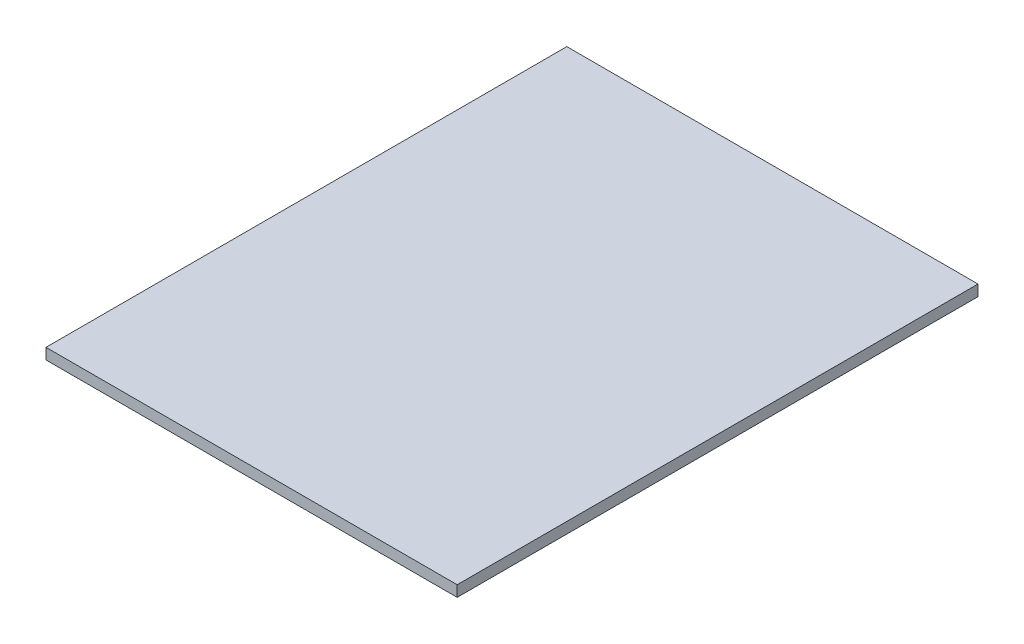
ISO-10303-21;
HEADER;
FILE_DESCRIPTION(('STEP AP214'),'2;1');
FILE_NAME('part.step','',(''),(''),'','','');
FILE_SCHEMA(('AUTOMOTIVE_DESIGN { 1 0 10303 214 1 1 1 1 }'));
ENDSEC;
DATA;
#1=APPLICATION_CONTEXT('core data for automotive mechanical design processes');
#2=APPLICATION_PROTOCOL_DEFINITION('international standard','automotive_design',2000,#1);
#3=PRODUCT_CONTEXT('',#1,'mechanical');
#4=PRODUCT('Part','Part','',(#3));
#5=PRODUCT_RELATED_PRODUCT_CATEGORY('part','',(#4));
#6=PRODUCT_DEFINITION_FORMATION('','',#4);
#7=PRODUCT_DEFINITION_CONTEXT('part definition',#1,'design');
#8=PRODUCT_DEFINITION('design','',#6,#7);
#9=PRODUCT_DEFINITION_SHAPE('','',#8);
#10=(LENGTH_UNIT() NAMED_UNIT(*) SI_UNIT(.MILLI.,.METRE.));
#11=(NAMED_UNIT(*) PLANE_ANGLE_UNIT() SI_UNIT($,.RADIAN.));
#12=(NAMED_UNIT(*) SI_UNIT($,.STERADIAN.) SOLID_ANGLE_UNIT());
#13=UNCERTAINTY_MEASURE_WITH_UNIT(LENGTH_MEASURE(1.E-05),#10,'distance_accuracy_value','');
#14=(GEOMETRIC_REPRESENTATION_CONTEXT(3) GLOBAL_UNCERTAINTY_ASSIGNED_CONTEXT((#13)) GLOBAL_UNIT_ASSIGNED_CONTEXT((#10,
#11,#12)) REPRESENTATION_CONTEXT('',''));
#15=CARTESIAN_POINT('',(0.,0.,0.));
#16=DIRECTION('',(0.,0.,1.));
#17=DIRECTION('',(1.,0.,0.));
#18=AXIS2_PLACEMENT_3D('',#15,#16,#17);
#19=CARTESIAN_POINT('',(95.25,5.08,120.65));
#20=DIRECTION('',(-1.,0.,0.));
#21=DIRECTION('',(0.,0.,1.));
#22=AXIS2_PLACEMENT_3D('',#19,#20,#21);
#23=PLANE('',#22);
#24=DIRECTION('',(0.,0.,-1.));
#25=VECTOR('',#24,1.);
#26=CARTESIAN_POINT('',(95.25,0.,120.65));
#27=LINE('',#26,#25);
#28=CARTESIAN_POINT('',(95.25,0.,120.65));
#29=VERTEX_POINT('',#28);
#30=CARTESIAN_POINT('',(95.25,0.,-120.65));
#31=VERTEX_POINT('',#30);
#32=EDGE_CURVE('E96',#29,#31,#27,.T.);
#33=ORIENTED_EDGE('',*,*,#32,.T.);
#34=DIRECTION('',(0.,-1.,0.));
#35=VECTOR('',#34,1.);
#36=CARTESIAN_POINT('',(95.25,5.08,-120.65));
#37=LINE('',#36,#35);
#38=CARTESIAN_POINT('',(95.25,5.08,-120.65));
#39=VERTEX_POINT('',#38);
#40=EDGE_CURVE('E11',#39,#31,#37,.T.);
#41=ORIENTED_EDGE('',*,*,#40,.F.);
#42=DIRECTION('',(0.,0.,-1.));
#43=VECTOR('',#42,1.);
#44=CARTESIAN_POINT('',(95.25,5.08,120.65));
#45=LINE('',#44,#43);
#46=CARTESIAN_POINT('',(95.25,5.08,120.65));
#47=VERTEX_POINT('',#46);
#48=EDGE_CURVE('E84',#47,#39,#45,.T.);
#49=ORIENTED_EDGE('',*,*,#48,.F.);
#50=DIRECTION('',(0.,-1.,0.));
#51=VECTOR('',#50,1.);
#52=CARTESIAN_POINT('',(95.25,5.08,120.65));
#53=LINE('',#52,#51);
#54=EDGE_CURVE('E92',#47,#29,#53,.T.);
#55=ORIENTED_EDGE('',*,*,#54,.T.);
#56=EDGE_LOOP('',(#33,#41,#49,#55));
#57=FACE_BOUND('',#56,.T.);
#58=ADVANCED_FACE('F33',(#57),#23,.F.);
#59=CARTESIAN_POINT('',(-95.25,5.08,-120.65));
#60=DIRECTION('',(0.,0.,1.));
#61=DIRECTION('',(1.,0.,0.));
#62=AXIS2_PLACEMENT_3D('',#59,#60,#61);
#63=PLANE('',#62);
#64=DIRECTION('',(-1.,0.,0.));
#65=VECTOR('',#64,1.);
#66=CARTESIAN_POINT('',(-95.25,0.,-120.65));
#67=LINE('',#66,#65);
#68=CARTESIAN_POINT('',(-95.25,0.,-120.65));
#69=VERTEX_POINT('',#68);
#70=EDGE_CURVE('E88',#31,#69,#67,.T.);
#71=ORIENTED_EDGE('',*,*,#70,.T.);
#72=DIRECTION('',(0.,-1.,0.));
#73=VECTOR('',#72,1.);
#74=CARTESIAN_POINT('',(-95.25,5.08,-120.65));
#75=LINE('',#74,#73);
#76=CARTESIAN_POINT('',(-95.25,5.08,-120.65));
#77=VERTEX_POINT('',#76);
#78=EDGE_CURVE('E41',#77,#69,#75,.T.);
#79=ORIENTED_EDGE('',*,*,#78,.F.);
#80=DIRECTION('',(-1.,0.,0.));
#81=VECTOR('',#80,1.);
#82=CARTESIAN_POINT('',(-95.25,5.08,-120.65));
#83=LINE('',#82,#81);
#84=EDGE_CURVE('E79',#39,#77,#83,.T.);
#85=ORIENTED_EDGE('',*,*,#84,.F.);
#86=ORIENTED_EDGE('',*,*,#40,.T.);
#87=EDGE_LOOP('',(#71,#79,#85,#86));
#88=FACE_BOUND('',#87,.T.);
#89=ADVANCED_FACE('F87',(#88),#63,.F.);
#90=CARTESIAN_POINT('',(-95.25,5.08,120.65));
#91=DIRECTION('',(1.,0.,0.));
#92=DIRECTION('',(0.,0.,-1.));
#93=AXIS2_PLACEMENT_3D('',#90,#91,#92);
#94=PLANE('',#93);
#95=DIRECTION('',(0.,0.,1.));
#96=VECTOR('',#95,1.);
#97=CARTESIAN_POINT('',(-95.25,0.,120.65));
#98=LINE('',#97,#96);
#99=CARTESIAN_POINT('',(-95.25,0.,120.65));
#100=VERTEX_POINT('',#99);
#101=EDGE_CURVE('E66',#69,#100,#98,.T.);
#102=ORIENTED_EDGE('',*,*,#101,.T.);
#103=DIRECTION('',(0.,-1.,0.));
#104=VECTOR('',#103,1.);
#105=CARTESIAN_POINT('',(-95.25,5.08,120.65));
#106=LINE('',#105,#104);
#107=CARTESIAN_POINT('',(-95.25,5.08,120.65));
#108=VERTEX_POINT('',#107);
#109=EDGE_CURVE('E89',#108,#100,#106,.T.);
#110=ORIENTED_EDGE('',*,*,#109,.F.);
#111=DIRECTION('',(0.,0.,1.));
#112=VECTOR('',#111,1.);
#113=CARTESIAN_POINT('',(-95.25,5.08,120.65));
#114=LINE('',#113,#112);
#115=EDGE_CURVE('E82',#77,#108,#114,.T.);
#116=ORIENTED_EDGE('',*,*,#115,.F.);
#117=ORIENTED_EDGE('',*,*,#78,.T.);
#118=EDGE_LOOP('',(#102,#110,#116,#117));
#119=FACE_BOUND('',#118,.T.);
#120=ADVANCED_FACE('F90',(#119),#94,.F.);
#121=CARTESIAN_POINT('',(-95.25,5.08,120.65));
#122=DIRECTION('',(0.,0.,-1.));
#123=DIRECTION('',(-1.,0.,0.));
#124=AXIS2_PLACEMENT_3D('',#121,#122,#123);
#125=PLANE('',#124);
#126=DIRECTION('',(1.,0.,0.));
#127=VECTOR('',#126,1.);
#128=CARTESIAN_POINT('',(-95.25,0.,120.65));
#129=LINE('',#128,#127);
#130=EDGE_CURVE('E72',#100,#29,#129,.T.);
#131=ORIENTED_EDGE('',*,*,#130,.T.);
#132=ORIENTED_EDGE('',*,*,#54,.F.);
#133=DIRECTION('',(1.,0.,0.));
#134=VECTOR('',#133,1.);
#135=CARTESIAN_POINT('',(-95.25,5.08,120.65));
#136=LINE('',#135,#134);
#137=EDGE_CURVE('E49',#108,#47,#136,.T.);
#138=ORIENTED_EDGE('',*,*,#137,.F.);
#139=ORIENTED_EDGE('',*,*,#109,.T.);
#140=EDGE_LOOP('',(#131,#132,#138,#139));
#141=FACE_BOUND('',#140,.T.);
#142=ADVANCED_FACE('F103',(#141),#125,.F.);
#143=CARTESIAN_POINT('',(0.,5.08,0.));
#144=DIRECTION('',(0.,-1.,0.));
#145=DIRECTION('',(0.,0.,-1.));
#146=AXIS2_PLACEMENT_3D('',#143,#144,#145);
#147=PLANE('',#146);
#148=ORIENTED_EDGE('',*,*,#48,.T.);
#149=ORIENTED_EDGE('',*,*,#84,.T.);
#150=ORIENTED_EDGE('',*,*,#115,.T.);
#151=ORIENTED_EDGE('',*,*,#137,.T.);
#152=EDGE_LOOP('',(#148,#149,#150,#151));
#153=FACE_BOUND('',#152,.T.);
#154=ADVANCED_FACE('F80',(#153),#147,.F.);
#155=CARTESIAN_POINT('',(0.,0.,0.));
#156=DIRECTION('',(0.,-1.,0.));
#157=DIRECTION('',(0.,0.,-1.));
#158=AXIS2_PLACEMENT_3D('',#155,#156,#157);
#159=PLANE('',#158);
#160=ORIENTED_EDGE('',*,*,#32,.F.);
#161=ORIENTED_EDGE('',*,*,#130,.F.);
#162=ORIENTED_EDGE('',*,*,#101,.F.);
#163=ORIENTED_EDGE('',*,*,#70,.F.);
#164=EDGE_LOOP('',(#160,#161,#162,#163));
#165=FACE_BOUND('',#164,.T.);
#166=ADVANCED_FACE('F106',(#165),#159,.T.);
#167=CLOSED_SHELL('',(#58,#89,#120,#142,#154,#166));
#168=MANIFOLD_SOLID_BREP('B2',#167);
#169=ADVANCED_BREP_SHAPE_REPRESENTATION('',(#18,#168),#14);
#170=SHAPE_DEFINITION_REPRESENTATION(#9,#169);
ENDSEC;
END-ISO-10303-21;
